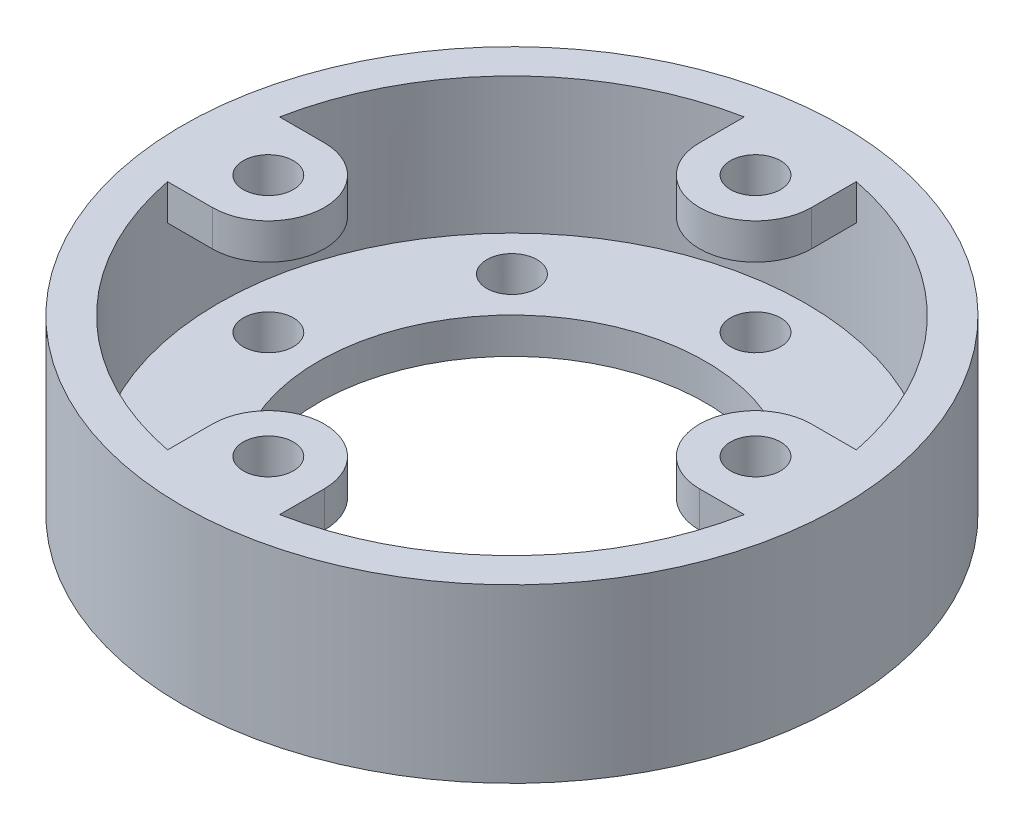
ISO-10303-21;
HEADER;
FILE_DESCRIPTION(('STEP AP214'),'2;1');
FILE_NAME('part.step','',(''),(''),'','','');
FILE_SCHEMA(('AUTOMOTIVE_DESIGN { 1 0 10303 214 1 1 1 1 }'));
ENDSEC;
DATA;
#1=APPLICATION_CONTEXT('core data for automotive mechanical design processes');
#2=APPLICATION_PROTOCOL_DEFINITION('international standard','automotive_design',2000,#1);
#3=PRODUCT_CONTEXT('',#1,'mechanical');
#4=PRODUCT('Part','Part','',(#3));
#5=PRODUCT_RELATED_PRODUCT_CATEGORY('part','',(#4));
#6=PRODUCT_DEFINITION_FORMATION('','',#4);
#7=PRODUCT_DEFINITION_CONTEXT('part definition',#1,'design');
#8=PRODUCT_DEFINITION('design','',#6,#7);
#9=PRODUCT_DEFINITION_SHAPE('','',#8);
#10=(LENGTH_UNIT() NAMED_UNIT(*) SI_UNIT(.MILLI.,.METRE.));
#11=(NAMED_UNIT(*) PLANE_ANGLE_UNIT() SI_UNIT($,.RADIAN.));
#12=(NAMED_UNIT(*) SI_UNIT($,.STERADIAN.) SOLID_ANGLE_UNIT());
#13=UNCERTAINTY_MEASURE_WITH_UNIT(LENGTH_MEASURE(1.E-05),#10,'distance_accuracy_value','');
#14=(GEOMETRIC_REPRESENTATION_CONTEXT(3) GLOBAL_UNCERTAINTY_ASSIGNED_CONTEXT((#13)) GLOBAL_UNIT_ASSIGNED_CONTEXT((#10,
#11,#12)) REPRESENTATION_CONTEXT('',''));
#15=CARTESIAN_POINT('',(0.,0.,0.));
#16=DIRECTION('',(0.,0.,1.));
#17=DIRECTION('',(1.,0.,0.));
#18=AXIS2_PLACEMENT_3D('',#15,#16,#17);
#19=CARTESIAN_POINT('',(0.,38.1,0.));
#20=DIRECTION('',(0.,-1.,0.));
#21=DIRECTION('',(0.,0.,-1.));
#22=AXIS2_PLACEMENT_3D('',#19,#20,#21);
#23=CYLINDRICAL_SURFACE('',#22,42.8625);
#24=CARTESIAN_POINT('',(0.,0.,0.));
#25=DIRECTION('',(0.,1.,0.));
#26=DIRECTION('',(0.,0.,1.));
#27=AXIS2_PLACEMENT_3D('',#24,#25,#26);
#28=CIRCLE('',#27,42.8625);
#29=CARTESIAN_POINT('',(0.,0.,42.8625));
#30=VERTEX_POINT('',#29);
#31=EDGE_CURVE('E343',#30,#30,#28,.T.);
#32=ORIENTED_EDGE('',*,*,#31,.F.);
#33=EDGE_LOOP('',(#32));
#34=FACE_BOUND('',#33,.T.);
#35=CARTESIAN_POINT('',(0.,7.9375,0.));
#36=DIRECTION('',(0.,1.,0.));
#37=DIRECTION('',(0.,0.,1.));
#38=AXIS2_PLACEMENT_3D('',#35,#36,#37);
#39=CIRCLE('',#38,42.8625);
#40=CARTESIAN_POINT('',(0.,7.9375,42.8625));
#41=VERTEX_POINT('',#40);
#42=EDGE_CURVE('E35',#41,#41,#39,.T.);
#43=ORIENTED_EDGE('',*,*,#42,.T.);
#44=EDGE_LOOP('',(#43));
#45=FACE_BOUND('',#44,.T.);
#46=ADVANCED_FACE('F31',(#34,#45),#23,.F.);
#47=CARTESIAN_POINT('',(0.,38.1,0.));
#48=DIRECTION('',(0.,1.,0.));
#49=DIRECTION('',(0.,0.,1.));
#50=AXIS2_PLACEMENT_3D('',#47,#48,#49);
#51=PLANE('',#50);
#52=CARTESIAN_POINT('',(0.,38.1,0.));
#53=DIRECTION('',(0.,1.,0.));
#54=DIRECTION('',(0.,0.,1.));
#55=AXIS2_PLACEMENT_3D('',#52,#53,#54);
#56=CIRCLE('',#55,65.0875);
#57=CARTESIAN_POINT('',(-12.4130389718077,38.1,-63.8928722138423));
#58=VERTEX_POINT('',#57);
#59=CARTESIAN_POINT('',(-63.8928722138422,38.1,-12.4130389718083));
#60=VERTEX_POINT('',#59);
#61=EDGE_CURVE('E337',#58,#60,#56,.T.);
#62=ORIENTED_EDGE('',*,*,#61,.F.);
#63=DIRECTION('',(0.,0.,1.));
#64=VECTOR('',#63,1.);
#65=CARTESIAN_POINT('',(-12.4130389718077,38.1,0.));
#66=LINE('',#65,#64);
#67=CARTESIAN_POINT('',(-12.4130389718077,38.1,-53.975));
#68=VERTEX_POINT('',#67);
#69=EDGE_CURVE('E262',#58,#68,#66,.T.);
#70=ORIENTED_EDGE('',*,*,#69,.T.);
#71=CARTESIAN_POINT('',(0.,38.1,-53.975));
#72=DIRECTION('',(0.,1.,0.));
#73=DIRECTION('',(0.,0.,1.));
#74=AXIS2_PLACEMENT_3D('',#71,#72,#73);
#75=CIRCLE('',#74,12.4130389718077);
#76=CARTESIAN_POINT('',(12.4130389718076,38.1,-53.975));
#77=VERTEX_POINT('',#76);
#78=EDGE_CURVE('E257',#77,#68,#75,.F.);
#79=ORIENTED_EDGE('',*,*,#78,.F.);
#80=DIRECTION('',(0.,0.,1.));
#81=VECTOR('',#80,1.);
#82=CARTESIAN_POINT('',(12.4130389718076,38.1,0.));
#83=LINE('',#82,#81);
#84=CARTESIAN_POINT('',(12.4130389718076,38.1,-63.8928722138423));
#85=VERTEX_POINT('',#84);
#86=EDGE_CURVE('E260',#85,#77,#83,.T.);
#87=ORIENTED_EDGE('',*,*,#86,.F.);
#88=CARTESIAN_POINT('',(63.8928722138424,38.1,-12.4130389718075));
#89=VERTEX_POINT('',#88);
#90=EDGE_CURVE('E336',#89,#85,#56,.T.);
#91=ORIENTED_EDGE('',*,*,#90,.F.);
#92=DIRECTION('',(-1.,0.,0.));
#93=VECTOR('',#92,1.);
#94=CARTESIAN_POINT('',(0.,38.1,-12.4130389718077));
#95=LINE('',#94,#93);
#96=CARTESIAN_POINT('',(53.975,38.1,-12.4130389718075));
#97=VERTEX_POINT('',#96);
#98=EDGE_CURVE('E228',#89,#97,#95,.T.);
#99=ORIENTED_EDGE('',*,*,#98,.T.);
#100=CARTESIAN_POINT('',(53.975,38.1,1.71105579656111E-13));
#101=DIRECTION('',(0.,1.,0.));
#102=DIRECTION('',(-1.,0.,0.));
#103=AXIS2_PLACEMENT_3D('',#100,#101,#102);
#104=CIRCLE('',#103,12.4130389718077);
#105=CARTESIAN_POINT('',(53.975,38.1,12.4130389718078));
#106=VERTEX_POINT('',#105);
#107=EDGE_CURVE('E223',#106,#97,#104,.F.);
#108=ORIENTED_EDGE('',*,*,#107,.F.);
#109=DIRECTION('',(-1.,0.,0.));
#110=VECTOR('',#109,1.);
#111=CARTESIAN_POINT('',(0.,38.1,12.4130389718076));
#112=LINE('',#111,#110);
#113=CARTESIAN_POINT('',(63.8928722138423,38.1,12.4130389718079));
#114=VERTEX_POINT('',#113);
#115=EDGE_CURVE('E226',#114,#106,#112,.T.);
#116=ORIENTED_EDGE('',*,*,#115,.F.);
#117=CARTESIAN_POINT('',(12.4130389718072,38.1,63.8928722138424));
#118=VERTEX_POINT('',#117);
#119=EDGE_CURVE('E571',#118,#114,#56,.T.);
#120=ORIENTED_EDGE('',*,*,#119,.F.);
#121=DIRECTION('',(0.,0.,-1.));
#122=VECTOR('',#121,1.);
#123=CARTESIAN_POINT('',(12.4130389718077,38.1,0.));
#124=LINE('',#123,#122);
#125=CARTESIAN_POINT('',(12.4130389718073,38.1,53.9750000000001));
#126=VERTEX_POINT('',#125);
#127=EDGE_CURVE('E194',#118,#126,#124,.T.);
#128=ORIENTED_EDGE('',*,*,#127,.T.);
#129=CARTESIAN_POINT('',(-3.5955839407199E-13,38.1,53.975));
#130=DIRECTION('',(0.,1.,0.));
#131=DIRECTION('',(0.,0.,-1.));
#132=AXIS2_PLACEMENT_3D('',#129,#130,#131);
#133=CIRCLE('',#132,12.4130389718077);
#134=CARTESIAN_POINT('',(-12.413038971808,38.1,53.9749999999999));
#135=VERTEX_POINT('',#134);
#136=EDGE_CURVE('E189',#135,#126,#133,.F.);
#137=ORIENTED_EDGE('',*,*,#136,.F.);
#138=DIRECTION('',(0.,0.,-1.));
#139=VECTOR('',#138,1.);
#140=CARTESIAN_POINT('',(-12.4130389718076,38.1,0.));
#141=LINE('',#140,#139);
#142=CARTESIAN_POINT('',(-12.4130389718081,38.1,63.8928722138422));
#143=VERTEX_POINT('',#142);
#144=EDGE_CURVE('E192',#143,#135,#141,.T.);
#145=ORIENTED_EDGE('',*,*,#144,.F.);
#146=CARTESIAN_POINT('',(-63.8928722138424,38.1,12.413038971807));
#147=VERTEX_POINT('',#146);
#148=EDGE_CURVE('E340',#147,#143,#56,.T.);
#149=ORIENTED_EDGE('',*,*,#148,.F.);
#150=DIRECTION('',(1.,0.,0.));
#151=VECTOR('',#150,1.);
#152=CARTESIAN_POINT('',(-1.23708125878737E-13,38.1,12.4130389718077));
#153=LINE('',#152,#151);
#154=CARTESIAN_POINT('',(-53.9750000000001,38.1,12.4130389718071));
#155=VERTEX_POINT('',#154);
#156=EDGE_CURVE('E152',#147,#155,#153,.T.);
#157=ORIENTED_EDGE('',*,*,#156,.T.);
#158=CARTESIAN_POINT('',(-53.975,38.1,-5.48011208487868E-13));
#159=DIRECTION('',(0.,1.,0.));
#160=DIRECTION('',(1.,0.,0.));
#161=AXIS2_PLACEMENT_3D('',#158,#159,#160);
#162=CIRCLE('',#161,12.4130389718077);
#163=CARTESIAN_POINT('',(-53.9749999999999,38.1,-12.4130389718082));
#164=VERTEX_POINT('',#163);
#165=EDGE_CURVE('E153',#164,#155,#162,.F.);
#166=ORIENTED_EDGE('',*,*,#165,.F.);
#167=DIRECTION('',(1.,0.,0.));
#168=VECTOR('',#167,1.);
#169=CARTESIAN_POINT('',(1.36331388306475E-13,38.1,-12.4130389718076));
#170=LINE('',#169,#168);
#171=EDGE_CURVE('E145',#60,#164,#170,.T.);
#172=ORIENTED_EDGE('',*,*,#171,.F.);
#173=EDGE_LOOP('',(#62,#70,#79,#87,#91,#99,#108,#116,#120,#128,#137,#145,#149,#157,#166,#172));
#174=FACE_BOUND('',#173,.T.);
#175=CARTESIAN_POINT('',(0.,38.1,0.));
#176=DIRECTION('',(0.,1.,0.));
#177=DIRECTION('',(0.,0.,1.));
#178=AXIS2_PLACEMENT_3D('',#175,#176,#177);
#179=CIRCLE('',#178,73.025);
#180=CARTESIAN_POINT('',(0.,38.1,73.025));
#181=VERTEX_POINT('',#180);
#182=EDGE_CURVE('E11',#181,#181,#179,.T.);
#183=ORIENTED_EDGE('',*,*,#182,.T.);
#184=EDGE_LOOP('',(#183));
#185=FACE_BOUND('',#184,.T.);
#186=CARTESIAN_POINT('',(0.,38.1,-53.975));
#187=DIRECTION('',(0.,1.,0.));
#188=DIRECTION('',(0.,0.,1.));
#189=AXIS2_PLACEMENT_3D('',#186,#187,#188);
#190=CIRCLE('',#189,5.55625);
#191=CARTESIAN_POINT('',(0.,38.1,-48.41875));
#192=VERTEX_POINT('',#191);
#193=EDGE_CURVE('E246',#192,#192,#190,.T.);
#194=ORIENTED_EDGE('',*,*,#193,.F.);
#195=EDGE_LOOP('',(#194));
#196=FACE_BOUND('',#195,.T.);
#197=CARTESIAN_POINT('',(53.975,38.1,1.71105579656111E-13));
#198=DIRECTION('',(0.,1.,0.));
#199=DIRECTION('',(-1.,0.,0.));
#200=AXIS2_PLACEMENT_3D('',#197,#198,#199);
#201=CIRCLE('',#200,5.55625);
#202=CARTESIAN_POINT('',(48.41875,38.1,1.51706025230947E-13));
#203=VERTEX_POINT('',#202);
#204=EDGE_CURVE('E212',#203,#203,#201,.T.);
#205=ORIENTED_EDGE('',*,*,#204,.F.);
#206=EDGE_LOOP('',(#205));
#207=FACE_BOUND('',#206,.T.);
#208=CARTESIAN_POINT('',(-3.5955839407199E-13,38.1,53.975));
#209=DIRECTION('',(0.,1.,0.));
#210=DIRECTION('',(0.,0.,-1.));
#211=AXIS2_PLACEMENT_3D('',#208,#209,#210);
#212=CIRCLE('',#211,5.55625);
#213=CARTESIAN_POINT('',(-3.20759285221662E-13,38.1,48.41875));
#214=VERTEX_POINT('',#213);
#215=EDGE_CURVE('E183',#214,#214,#212,.T.);
#216=ORIENTED_EDGE('',*,*,#215,.F.);
#217=EDGE_LOOP('',(#216));
#218=FACE_BOUND('',#217,.T.);
#219=CARTESIAN_POINT('',(-53.975,38.1,-5.48011208487868E-13));
#220=DIRECTION('',(0.,1.,0.));
#221=DIRECTION('',(1.,0.,0.));
#222=AXIS2_PLACEMENT_3D('',#219,#220,#221);
#223=CIRCLE('',#222,5.55625);
#224=CARTESIAN_POINT('',(-48.41875,38.1,-4.89812545212376E-13));
#225=VERTEX_POINT('',#224);
#226=EDGE_CURVE('E166',#225,#225,#223,.T.);
#227=ORIENTED_EDGE('',*,*,#226,.F.);
#228=EDGE_LOOP('',(#227));
#229=FACE_BOUND('',#228,.T.);
#230=ADVANCED_FACE('F163',(#174,#185,#196,#207,#218,#229),#51,.T.);
#231=CARTESIAN_POINT('',(0.,0.,0.));
#232=DIRECTION('',(0.,1.,0.));
#233=DIRECTION('',(0.,0.,1.));
#234=AXIS2_PLACEMENT_3D('',#231,#232,#233);
#235=PLANE('',#234);
#236=CARTESIAN_POINT('',(-38.1660885145434,0.,-38.1660885145444));
#237=DIRECTION('',(0.,1.,0.));
#238=DIRECTION('',(0.,0.,1.));
#239=AXIS2_PLACEMENT_3D('',#236,#237,#238);
#240=CIRCLE('',#239,5.55625);
#241=CARTESIAN_POINT('',(-38.1660885145434,0.,-32.6098385145444));
#242=VERTEX_POINT('',#241);
#243=EDGE_CURVE('E291',#242,#242,#240,.T.);
#244=ORIENTED_EDGE('',*,*,#243,.T.);
#245=EDGE_LOOP('',(#244));
#246=FACE_BOUND('',#245,.T.);
#247=CARTESIAN_POINT('',(-53.975,0.,-5.65358443247637E-13));
#248=DIRECTION('',(0.,1.,0.));
#249=DIRECTION('',(0.,0.,1.));
#250=AXIS2_PLACEMENT_3D('',#247,#248,#249);
#251=CIRCLE('',#250,5.55625);
#252=CARTESIAN_POINT('',(-53.975,0.,5.55624999999943));
#253=VERTEX_POINT('',#252);
#254=EDGE_CURVE('E297',#253,#253,#251,.T.);
#255=ORIENTED_EDGE('',*,*,#254,.T.);
#256=EDGE_LOOP('',(#255));
#257=FACE_BOUND('',#256,.T.);
#258=CARTESIAN_POINT('',(-38.1660885145442,0.,38.1660885145436));
#259=DIRECTION('',(0.,1.,0.));
#260=DIRECTION('',(0.,0.,1.));
#261=AXIS2_PLACEMENT_3D('',#258,#259,#260);
#262=CIRCLE('',#261,5.55625);
#263=CARTESIAN_POINT('',(-38.1660885145442,0.,43.7223385145436));
#264=VERTEX_POINT('',#263);
#265=EDGE_CURVE('E303',#264,#264,#262,.T.);
#266=ORIENTED_EDGE('',*,*,#265,.T.);
#267=EDGE_LOOP('',(#266));
#268=FACE_BOUND('',#267,.T.);
#269=CARTESIAN_POINT('',(-3.76905628831758E-13,0.,53.975));
#270=DIRECTION('',(0.,1.,0.));
#271=DIRECTION('',(0.,0.,1.));
#272=AXIS2_PLACEMENT_3D('',#269,#270,#271);
#273=CIRCLE('',#272,5.55625);
#274=CARTESIAN_POINT('',(-3.76905628831758E-13,0.,59.53125));
#275=VERTEX_POINT('',#274);
#276=EDGE_CURVE('E309',#275,#275,#273,.T.);
#277=ORIENTED_EDGE('',*,*,#276,.T.);
#278=EDGE_LOOP('',(#277));
#279=FACE_BOUND('',#278,.T.);
#280=CARTESIAN_POINT('',(38.1660885145437,0.,38.1660885145441));
#281=DIRECTION('',(0.,1.,0.));
#282=DIRECTION('',(0.,0.,1.));
#283=AXIS2_PLACEMENT_3D('',#280,#281,#282);
#284=CIRCLE('',#283,5.55625);
#285=CARTESIAN_POINT('',(38.1660885145437,0.,43.7223385145441));
#286=VERTEX_POINT('',#285);
#287=EDGE_CURVE('E315',#286,#286,#284,.T.);
#288=ORIENTED_EDGE('',*,*,#287,.T.);
#289=EDGE_LOOP('',(#288));
#290=FACE_BOUND('',#289,.T.);
#291=CARTESIAN_POINT('',(53.975,0.,1.88452814415879E-13));
#292=DIRECTION('',(0.,1.,0.));
#293=DIRECTION('',(0.,0.,1.));
#294=AXIS2_PLACEMENT_3D('',#291,#292,#293);
#295=CIRCLE('',#294,5.55625);
#296=CARTESIAN_POINT('',(53.975,0.,5.55625000000019));
#297=VERTEX_POINT('',#296);
#298=EDGE_CURVE('E321',#297,#297,#295,.T.);
#299=ORIENTED_EDGE('',*,*,#298,.T.);
#300=EDGE_LOOP('',(#299));
#301=FACE_BOUND('',#300,.T.);
#302=CARTESIAN_POINT('',(38.166088514544,0.,-38.1660885145438));
#303=DIRECTION('',(0.,1.,0.));
#304=DIRECTION('',(0.,0.,1.));
#305=AXIS2_PLACEMENT_3D('',#302,#303,#304);
#306=CIRCLE('',#305,5.55625);
#307=CARTESIAN_POINT('',(38.166088514544,0.,-32.6098385145438));
#308=VERTEX_POINT('',#307);
#309=EDGE_CURVE('E327',#308,#308,#306,.T.);
#310=ORIENTED_EDGE('',*,*,#309,.T.);
#311=EDGE_LOOP('',(#310));
#312=FACE_BOUND('',#311,.T.);
#313=CARTESIAN_POINT('',(0.,0.,-53.975));
#314=DIRECTION('',(0.,1.,0.));
#315=DIRECTION('',(0.,0.,1.));
#316=AXIS2_PLACEMENT_3D('',#313,#314,#315);
#317=CIRCLE('',#316,5.55625);
#318=CARTESIAN_POINT('',(0.,0.,-48.41875));
#319=VERTEX_POINT('',#318);
#320=EDGE_CURVE('E333',#319,#319,#317,.T.);
#321=ORIENTED_EDGE('',*,*,#320,.T.);
#322=EDGE_LOOP('',(#321));
#323=FACE_BOUND('',#322,.T.);
#324=CARTESIAN_POINT('',(0.,0.,0.));
#325=DIRECTION('',(0.,1.,0.));
#326=DIRECTION('',(0.,0.,1.));
#327=AXIS2_PLACEMENT_3D('',#324,#325,#326);
#328=CIRCLE('',#327,73.025);
#329=CARTESIAN_POINT('',(0.,0.,73.025));
#330=VERTEX_POINT('',#329);
#331=EDGE_CURVE('E40',#330,#330,#328,.T.);
#332=ORIENTED_EDGE('',*,*,#331,.F.);
#333=EDGE_LOOP('',(#332));
#334=FACE_BOUND('',#333,.T.);
#335=ORIENTED_EDGE('',*,*,#31,.T.);
#336=EDGE_LOOP('',(#335));
#337=FACE_BOUND('',#336,.T.);
#338=ADVANCED_FACE('F350',(#246,#257,#268,#279,#290,#301,#312,#323,#334,#337),#235,.F.);
#339=CARTESIAN_POINT('',(0.,38.1,0.));
#340=DIRECTION('',(0.,-1.,0.));
#341=DIRECTION('',(0.,0.,-1.));
#342=AXIS2_PLACEMENT_3D('',#339,#340,#341);
#343=CYLINDRICAL_SURFACE('',#342,73.025);
#344=ORIENTED_EDGE('',*,*,#182,.F.);
#345=EDGE_LOOP('',(#344));
#346=FACE_BOUND('',#345,.T.);
#347=ORIENTED_EDGE('',*,*,#331,.T.);
#348=EDGE_LOOP('',(#347));
#349=FACE_BOUND('',#348,.T.);
#350=ADVANCED_FACE('F33',(#346,#349),#343,.T.);
#351=CARTESIAN_POINT('',(0.,7.9375,0.));
#352=DIRECTION('',(0.,1.,0.));
#353=DIRECTION('',(0.,0.,1.));
#354=AXIS2_PLACEMENT_3D('',#351,#352,#353);
#355=CYLINDRICAL_SURFACE('',#354,65.0875);
#356=CARTESIAN_POINT('',(0.,30.1625,0.));
#357=DIRECTION('',(0.,1.,0.));
#358=DIRECTION('',(1.,0.,0.));
#359=AXIS2_PLACEMENT_3D('',#356,#357,#358);
#360=CIRCLE('',#359,65.0875);
#361=CARTESIAN_POINT('',(-63.8928722138422,30.1625,-12.4130389718083));
#362=VERTEX_POINT('',#361);
#363=CARTESIAN_POINT('',(-63.8928722138424,30.1625,12.413038971807));
#364=VERTEX_POINT('',#363);
#365=EDGE_CURVE('E52',#362,#364,#360,.T.);
#366=ORIENTED_EDGE('',*,*,#365,.T.);
#367=DIRECTION('',(0.,1.,0.));
#368=VECTOR('',#367,1.);
#369=CARTESIAN_POINT('',(-63.8928722138424,30.1625,12.413038971807));
#370=LINE('',#369,#368);
#371=EDGE_CURVE('E184',#364,#147,#370,.T.);
#372=ORIENTED_EDGE('',*,*,#371,.T.);
#373=ORIENTED_EDGE('',*,*,#148,.T.);
#374=DIRECTION('',(0.,1.,0.));
#375=VECTOR('',#374,1.);
#376=CARTESIAN_POINT('',(-12.4130389718081,30.1625,63.8928722138422));
#377=LINE('',#376,#375);
#378=CARTESIAN_POINT('',(-12.4130389718081,30.1625,63.8928722138422));
#379=VERTEX_POINT('',#378);
#380=EDGE_CURVE('E216',#379,#143,#377,.T.);
#381=ORIENTED_EDGE('',*,*,#380,.F.);
#382=CARTESIAN_POINT('',(0.,30.1625,0.));
#383=DIRECTION('',(0.,1.,0.));
#384=DIRECTION('',(0.,0.,-1.));
#385=AXIS2_PLACEMENT_3D('',#382,#383,#384);
#386=CIRCLE('',#385,65.0875);
#387=CARTESIAN_POINT('',(12.4130389718072,30.1625,63.8928722138424));
#388=VERTEX_POINT('',#387);
#389=EDGE_CURVE('E204',#379,#388,#386,.T.);
#390=ORIENTED_EDGE('',*,*,#389,.T.);
#391=DIRECTION('',(0.,1.,0.));
#392=VECTOR('',#391,1.);
#393=CARTESIAN_POINT('',(12.4130389718072,30.1625,63.8928722138424));
#394=LINE('',#393,#392);
#395=EDGE_CURVE('E213',#388,#118,#394,.T.);
#396=ORIENTED_EDGE('',*,*,#395,.T.);
#397=ORIENTED_EDGE('',*,*,#119,.T.);
#398=DIRECTION('',(0.,1.,0.));
#399=VECTOR('',#398,1.);
#400=CARTESIAN_POINT('',(63.8928722138423,30.1625,12.4130389718079));
#401=LINE('',#400,#399);
#402=CARTESIAN_POINT('',(63.8928722138423,30.1625,12.4130389718079));
#403=VERTEX_POINT('',#402);
#404=EDGE_CURVE('E250',#403,#114,#401,.T.);
#405=ORIENTED_EDGE('',*,*,#404,.F.);
#406=CARTESIAN_POINT('',(0.,30.1625,0.));
#407=DIRECTION('',(0.,1.,0.));
#408=DIRECTION('',(-1.,0.,0.));
#409=AXIS2_PLACEMENT_3D('',#406,#407,#408);
#410=CIRCLE('',#409,65.0875);
#411=CARTESIAN_POINT('',(63.8928722138424,30.1625,-12.4130389718075));
#412=VERTEX_POINT('',#411);
#413=EDGE_CURVE('E238',#403,#412,#410,.T.);
#414=ORIENTED_EDGE('',*,*,#413,.T.);
#415=DIRECTION('',(0.,1.,0.));
#416=VECTOR('',#415,1.);
#417=CARTESIAN_POINT('',(63.8928722138424,30.1625,-12.4130389718075));
#418=LINE('',#417,#416);
#419=EDGE_CURVE('E247',#412,#89,#418,.T.);
#420=ORIENTED_EDGE('',*,*,#419,.T.);
#421=ORIENTED_EDGE('',*,*,#90,.T.);
#422=DIRECTION('',(0.,1.,0.));
#423=VECTOR('',#422,1.);
#424=CARTESIAN_POINT('',(12.4130389718076,30.1625,-63.8928722138423));
#425=LINE('',#424,#423);
#426=CARTESIAN_POINT('',(12.4130389718076,30.1625,-63.8928722138423));
#427=VERTEX_POINT('',#426);
#428=EDGE_CURVE('E284',#427,#85,#425,.T.);
#429=ORIENTED_EDGE('',*,*,#428,.F.);
#430=CARTESIAN_POINT('',(0.,30.1625,0.));
#431=DIRECTION('',(0.,1.,0.));
#432=DIRECTION('',(0.,0.,1.));
#433=AXIS2_PLACEMENT_3D('',#430,#431,#432);
#434=CIRCLE('',#433,65.0875);
#435=CARTESIAN_POINT('',(-12.4130389718077,30.1625,-63.8928722138423));
#436=VERTEX_POINT('',#435);
#437=EDGE_CURVE('E272',#427,#436,#434,.T.);
#438=ORIENTED_EDGE('',*,*,#437,.T.);
#439=DIRECTION('',(0.,1.,0.));
#440=VECTOR('',#439,1.);
#441=CARTESIAN_POINT('',(-12.4130389718077,30.1625,-63.8928722138423));
#442=LINE('',#441,#440);
#443=EDGE_CURVE('E281',#436,#58,#442,.T.);
#444=ORIENTED_EDGE('',*,*,#443,.T.);
#445=ORIENTED_EDGE('',*,*,#61,.T.);
#446=DIRECTION('',(0.,1.,0.));
#447=VECTOR('',#446,1.);
#448=CARTESIAN_POINT('',(-63.8928722138422,30.1625,-12.4130389718083));
#449=LINE('',#448,#447);
#450=EDGE_CURVE('E47',#362,#60,#449,.T.);
#451=ORIENTED_EDGE('',*,*,#450,.F.);
#452=EDGE_LOOP('',(#366,#372,#373,#381,#390,#396,#397,#405,#414,#420,#421,#429,#438,#444,#445,#451));
#453=FACE_BOUND('',#452,.T.);
#454=CARTESIAN_POINT('',(0.,7.9375,0.));
#455=DIRECTION('',(0.,1.,0.));
#456=DIRECTION('',(0.,0.,1.));
#457=AXIS2_PLACEMENT_3D('',#454,#455,#456);
#458=CIRCLE('',#457,65.0875);
#459=CARTESIAN_POINT('',(0.,7.9375,65.0875));
#460=VERTEX_POINT('',#459);
#461=EDGE_CURVE('E339',#460,#460,#458,.T.);
#462=ORIENTED_EDGE('',*,*,#461,.F.);
#463=EDGE_LOOP('',(#462));
#464=FACE_BOUND('',#463,.T.);
#465=ADVANCED_FACE('F367',(#453,#464),#355,.F.);
#466=CARTESIAN_POINT('',(0.,7.9375,0.));
#467=DIRECTION('',(0.,1.,0.));
#468=DIRECTION('',(0.,0.,1.));
#469=AXIS2_PLACEMENT_3D('',#466,#467,#468);
#470=PLANE('',#469);
#471=CARTESIAN_POINT('',(-38.1660885145434,7.9375,-38.1660885145444));
#472=DIRECTION('',(0.,1.,0.));
#473=DIRECTION('',(0.707106781186539,0.,0.707106781186556));
#474=AXIS2_PLACEMENT_3D('',#471,#472,#473);
#475=CIRCLE('',#474,5.55625);
#476=CARTESIAN_POINT('',(-34.2372264615757,7.9375,-34.2372264615766));
#477=VERTEX_POINT('',#476);
#478=EDGE_CURVE('E280',#477,#477,#475,.T.);
#479=ORIENTED_EDGE('',*,*,#478,.F.);
#480=EDGE_LOOP('',(#479));
#481=FACE_BOUND('',#480,.T.);
#482=CARTESIAN_POINT('',(-53.975,7.9375,-5.65358443247637E-13));
#483=DIRECTION('',(0.,1.,0.));
#484=DIRECTION('',(1.,0.,0.));
#485=AXIS2_PLACEMENT_3D('',#482,#483,#484);
#486=CIRCLE('',#485,5.55625);
#487=CARTESIAN_POINT('',(-48.41875,7.9375,-5.07159779972145E-13));
#488=VERTEX_POINT('',#487);
#489=EDGE_CURVE('E294',#488,#488,#486,.T.);
#490=ORIENTED_EDGE('',*,*,#489,.F.);
#491=EDGE_LOOP('',(#490));
#492=FACE_BOUND('',#491,.T.);
#493=CARTESIAN_POINT('',(-38.1660885145442,7.9375,38.1660885145436));
#494=DIRECTION('',(0.,1.,0.));
#495=DIRECTION('',(0.707106781186554,0.,-0.707106781186541));
#496=AXIS2_PLACEMENT_3D('',#493,#494,#495);
#497=CIRCLE('',#496,5.55625);
#498=CARTESIAN_POINT('',(-34.2372264615764,7.9375,34.2372264615759));
#499=VERTEX_POINT('',#498);
#500=EDGE_CURVE('E300',#499,#499,#497,.T.);
#501=ORIENTED_EDGE('',*,*,#500,.F.);
#502=EDGE_LOOP('',(#501));
#503=FACE_BOUND('',#502,.T.);
#504=CARTESIAN_POINT('',(-3.76905628831758E-13,7.9375,53.975));
#505=DIRECTION('',(0.,1.,0.));
#506=DIRECTION('',(0.,0.,-1.));
#507=AXIS2_PLACEMENT_3D('',#504,#505,#506);
#508=CIRCLE('',#507,5.55625);
#509=CARTESIAN_POINT('',(-3.3810651998143E-13,7.9375,48.41875));
#510=VERTEX_POINT('',#509);
#511=EDGE_CURVE('E306',#510,#510,#508,.T.);
#512=ORIENTED_EDGE('',*,*,#511,.F.);
#513=EDGE_LOOP('',(#512));
#514=FACE_BOUND('',#513,.T.);
#515=CARTESIAN_POINT('',(38.1660885145437,7.9375,38.1660885145441));
#516=DIRECTION('',(0.,1.,0.));
#517=DIRECTION('',(-0.707106781186544,0.,-0.707106781186551));
#518=AXIS2_PLACEMENT_3D('',#515,#516,#517);
#519=CIRCLE('',#518,5.55625);
#520=CARTESIAN_POINT('',(34.237226461576,7.9375,34.2372264615763));
#521=VERTEX_POINT('',#520);
#522=EDGE_CURVE('E312',#521,#521,#519,.T.);
#523=ORIENTED_EDGE('',*,*,#522,.F.);
#524=EDGE_LOOP('',(#523));
#525=FACE_BOUND('',#524,.T.);
#526=CARTESIAN_POINT('',(53.975,7.9375,1.88452814415879E-13));
#527=DIRECTION('',(0.,1.,0.));
#528=DIRECTION('',(-1.,0.,0.));
#529=AXIS2_PLACEMENT_3D('',#526,#527,#528);
#530=CIRCLE('',#529,5.55625);
#531=CARTESIAN_POINT('',(48.41875,7.9375,1.69053259990715E-13));
#532=VERTEX_POINT('',#531);
#533=EDGE_CURVE('E318',#532,#532,#530,.T.);
#534=ORIENTED_EDGE('',*,*,#533,.F.);
#535=EDGE_LOOP('',(#534));
#536=FACE_BOUND('',#535,.T.);
#537=CARTESIAN_POINT('',(38.166088514544,7.9375,-38.1660885145438));
#538=DIRECTION('',(0.,1.,0.));
#539=DIRECTION('',(-0.707106781186549,0.,0.707106781186546));
#540=AXIS2_PLACEMENT_3D('',#537,#538,#539);
#541=CIRCLE('',#540,5.55625);
#542=CARTESIAN_POINT('',(34.2372264615762,7.9375,-34.2372264615761));
#543=VERTEX_POINT('',#542);
#544=EDGE_CURVE('E324',#543,#543,#541,.T.);
#545=ORIENTED_EDGE('',*,*,#544,.F.);
#546=EDGE_LOOP('',(#545));
#547=FACE_BOUND('',#546,.T.);
#548=CARTESIAN_POINT('',(0.,7.9375,-53.975));
#549=DIRECTION('',(0.,1.,0.));
#550=DIRECTION('',(0.,0.,1.));
#551=AXIS2_PLACEMENT_3D('',#548,#549,#550);
#552=CIRCLE('',#551,5.55625);
#553=CARTESIAN_POINT('',(0.,7.9375,-48.41875));
#554=VERTEX_POINT('',#553);
#555=EDGE_CURVE('E330',#554,#554,#552,.T.);
#556=ORIENTED_EDGE('',*,*,#555,.F.);
#557=EDGE_LOOP('',(#556));
#558=FACE_BOUND('',#557,.T.);
#559=ORIENTED_EDGE('',*,*,#42,.F.);
#560=EDGE_LOOP('',(#559));
#561=FACE_BOUND('',#560,.T.);
#562=ORIENTED_EDGE('',*,*,#461,.T.);
#563=EDGE_LOOP('',(#562));
#564=FACE_BOUND('',#563,.T.);
#565=ADVANCED_FACE('F363',(#481,#492,#503,#514,#525,#536,#547,#558,#561,#564),#470,.T.);
#566=CARTESIAN_POINT('',(0.,-22.225,-53.975));
#567=DIRECTION('',(0.,1.,0.));
#568=DIRECTION('',(0.,0.,1.));
#569=AXIS2_PLACEMENT_3D('',#566,#567,#568);
#570=CYLINDRICAL_SURFACE('',#569,5.55625);
#571=ORIENTED_EDGE('',*,*,#555,.T.);
#572=EDGE_LOOP('',(#571));
#573=FACE_BOUND('',#572,.T.);
#574=ORIENTED_EDGE('',*,*,#320,.F.);
#575=EDGE_LOOP('',(#574));
#576=FACE_BOUND('',#575,.T.);
#577=ADVANCED_FACE('F366',(#573,#576),#570,.F.);
#578=CARTESIAN_POINT('',(38.166088514544,-22.225,-38.1660885145438));
#579=DIRECTION('',(0.,1.,0.));
#580=DIRECTION('',(0.,0.,1.));
#581=AXIS2_PLACEMENT_3D('',#578,#579,#580);
#582=CYLINDRICAL_SURFACE('',#581,5.55625);
#583=ORIENTED_EDGE('',*,*,#544,.T.);
#584=EDGE_LOOP('',(#583));
#585=FACE_BOUND('',#584,.T.);
#586=ORIENTED_EDGE('',*,*,#309,.F.);
#587=EDGE_LOOP('',(#586));
#588=FACE_BOUND('',#587,.T.);
#589=ADVANCED_FACE('F473',(#585,#588),#582,.F.);
#590=CARTESIAN_POINT('',(53.975,-22.225,1.88452814415879E-13));
#591=DIRECTION('',(0.,1.,0.));
#592=DIRECTION('',(0.,0.,1.));
#593=AXIS2_PLACEMENT_3D('',#590,#591,#592);
#594=CYLINDRICAL_SURFACE('',#593,5.55625);
#595=ORIENTED_EDGE('',*,*,#533,.T.);
#596=EDGE_LOOP('',(#595));
#597=FACE_BOUND('',#596,.T.);
#598=ORIENTED_EDGE('',*,*,#298,.F.);
#599=EDGE_LOOP('',(#598));
#600=FACE_BOUND('',#599,.T.);
#601=ADVANCED_FACE('F465',(#597,#600),#594,.F.);
#602=CARTESIAN_POINT('',(38.1660885145437,-22.225,38.1660885145441));
#603=DIRECTION('',(0.,1.,0.));
#604=DIRECTION('',(0.,0.,1.));
#605=AXIS2_PLACEMENT_3D('',#602,#603,#604);
#606=CYLINDRICAL_SURFACE('',#605,5.55625);
#607=ORIENTED_EDGE('',*,*,#522,.T.);
#608=EDGE_LOOP('',(#607));
#609=FACE_BOUND('',#608,.T.);
#610=ORIENTED_EDGE('',*,*,#287,.F.);
#611=EDGE_LOOP('',(#610));
#612=FACE_BOUND('',#611,.T.);
#613=ADVANCED_FACE('F457',(#609,#612),#606,.F.);
#614=CARTESIAN_POINT('',(-3.76905628831758E-13,-22.225,53.975));
#615=DIRECTION('',(0.,1.,0.));
#616=DIRECTION('',(0.,0.,1.));
#617=AXIS2_PLACEMENT_3D('',#614,#615,#616);
#618=CYLINDRICAL_SURFACE('',#617,5.55625);
#619=ORIENTED_EDGE('',*,*,#511,.T.);
#620=EDGE_LOOP('',(#619));
#621=FACE_BOUND('',#620,.T.);
#622=ORIENTED_EDGE('',*,*,#276,.F.);
#623=EDGE_LOOP('',(#622));
#624=FACE_BOUND('',#623,.T.);
#625=ADVANCED_FACE('F449',(#621,#624),#618,.F.);
#626=CARTESIAN_POINT('',(-38.1660885145442,-22.225,38.1660885145436));
#627=DIRECTION('',(0.,1.,0.));
#628=DIRECTION('',(0.,0.,1.));
#629=AXIS2_PLACEMENT_3D('',#626,#627,#628);
#630=CYLINDRICAL_SURFACE('',#629,5.55625);
#631=ORIENTED_EDGE('',*,*,#500,.T.);
#632=EDGE_LOOP('',(#631));
#633=FACE_BOUND('',#632,.T.);
#634=ORIENTED_EDGE('',*,*,#265,.F.);
#635=EDGE_LOOP('',(#634));
#636=FACE_BOUND('',#635,.T.);
#637=ADVANCED_FACE('F441',(#633,#636),#630,.F.);
#638=CARTESIAN_POINT('',(-53.975,-22.225,-5.65358443247637E-13));
#639=DIRECTION('',(0.,1.,0.));
#640=DIRECTION('',(0.,0.,1.));
#641=AXIS2_PLACEMENT_3D('',#638,#639,#640);
#642=CYLINDRICAL_SURFACE('',#641,5.55625);
#643=ORIENTED_EDGE('',*,*,#489,.T.);
#644=EDGE_LOOP('',(#643));
#645=FACE_BOUND('',#644,.T.);
#646=ORIENTED_EDGE('',*,*,#254,.F.);
#647=EDGE_LOOP('',(#646));
#648=FACE_BOUND('',#647,.T.);
#649=ADVANCED_FACE('F433',(#645,#648),#642,.F.);
#650=CARTESIAN_POINT('',(-38.1660885145434,-22.225,-38.1660885145444));
#651=DIRECTION('',(0.,1.,0.));
#652=DIRECTION('',(0.,0.,1.));
#653=AXIS2_PLACEMENT_3D('',#650,#651,#652);
#654=CYLINDRICAL_SURFACE('',#653,5.55625);
#655=ORIENTED_EDGE('',*,*,#478,.T.);
#656=EDGE_LOOP('',(#655));
#657=FACE_BOUND('',#656,.T.);
#658=ORIENTED_EDGE('',*,*,#243,.F.);
#659=EDGE_LOOP('',(#658));
#660=FACE_BOUND('',#659,.T.);
#661=ADVANCED_FACE('F425',(#657,#660),#654,.F.);
#662=CARTESIAN_POINT('',(0.,30.1625,-53.975));
#663=DIRECTION('',(0.,1.,0.));
#664=DIRECTION('',(0.,0.,1.));
#665=AXIS2_PLACEMENT_3D('',#662,#663,#664);
#666=CYLINDRICAL_SURFACE('',#665,12.4130389718077);
#667=ORIENTED_EDGE('',*,*,#78,.T.);
#668=DIRECTION('',(0.,1.,0.));
#669=VECTOR('',#668,1.);
#670=CARTESIAN_POINT('',(-12.4130389718077,30.1625,-53.975));
#671=LINE('',#670,#669);
#672=CARTESIAN_POINT('',(-12.4130389718077,30.1625,-53.975));
#673=VERTEX_POINT('',#672);
#674=EDGE_CURVE('E278',#673,#68,#671,.T.);
#675=ORIENTED_EDGE('',*,*,#674,.F.);
#676=CARTESIAN_POINT('',(0.,30.1625,-53.975));
#677=DIRECTION('',(0.,1.,0.));
#678=DIRECTION('',(0.,0.,1.));
#679=AXIS2_PLACEMENT_3D('',#676,#677,#678);
#680=CIRCLE('',#679,12.4130389718077);
#681=CARTESIAN_POINT('',(12.4130389718076,30.1625,-53.975));
#682=VERTEX_POINT('',#681);
#683=EDGE_CURVE('E268',#682,#673,#680,.F.);
#684=ORIENTED_EDGE('',*,*,#683,.F.);
#685=DIRECTION('',(0.,1.,0.));
#686=VECTOR('',#685,1.);
#687=CARTESIAN_POINT('',(12.4130389718076,30.1625,-53.975));
#688=LINE('',#687,#686);
#689=EDGE_CURVE('E277',#682,#77,#688,.T.);
#690=ORIENTED_EDGE('',*,*,#689,.T.);
#691=EDGE_LOOP('',(#667,#675,#684,#690));
#692=FACE_BOUND('',#691,.T.);
#693=ADVANCED_FACE('F417',(#692),#666,.T.);
#694=CARTESIAN_POINT('',(-12.4130389718077,30.1625,0.));
#695=DIRECTION('',(-1.,0.,0.));
#696=DIRECTION('',(0.,0.,1.));
#697=AXIS2_PLACEMENT_3D('',#694,#695,#696);
#698=PLANE('',#697);
#699=ORIENTED_EDGE('',*,*,#69,.F.);
#700=ORIENTED_EDGE('',*,*,#443,.F.);
#701=DIRECTION('',(0.,0.,1.));
#702=VECTOR('',#701,1.);
#703=CARTESIAN_POINT('',(-12.4130389718077,30.1625,0.));
#704=LINE('',#703,#702);
#705=EDGE_CURVE('E274',#436,#673,#704,.T.);
#706=ORIENTED_EDGE('',*,*,#705,.T.);
#707=ORIENTED_EDGE('',*,*,#674,.T.);
#708=EDGE_LOOP('',(#699,#700,#706,#707));
#709=FACE_BOUND('',#708,.T.);
#710=ADVANCED_FACE('F409',(#709),#698,.T.);
#711=CARTESIAN_POINT('',(0.,30.1625,-53.975));
#712=DIRECTION('',(0.,1.,0.));
#713=DIRECTION('',(0.,0.,1.));
#714=AXIS2_PLACEMENT_3D('',#711,#712,#713);
#715=CYLINDRICAL_SURFACE('',#714,5.55625);
#716=CARTESIAN_POINT('',(0.,30.1625,-53.975));
#717=DIRECTION('',(0.,1.,0.));
#718=DIRECTION('',(0.,0.,1.));
#719=AXIS2_PLACEMENT_3D('',#716,#717,#718);
#720=CIRCLE('',#719,5.55625);
#721=CARTESIAN_POINT('',(0.,30.1625,-48.41875));
#722=VERTEX_POINT('',#721);
#723=EDGE_CURVE('E265',#722,#722,#720,.T.);
#724=ORIENTED_EDGE('',*,*,#723,.F.);
#725=EDGE_LOOP('',(#724));
#726=FACE_BOUND('',#725,.T.);
#727=ORIENTED_EDGE('',*,*,#193,.T.);
#728=EDGE_LOOP('',(#727));
#729=FACE_BOUND('',#728,.T.);
#730=ADVANCED_FACE('F401',(#726,#729),#715,.F.);
#731=CARTESIAN_POINT('',(12.4130389718076,30.1625,0.));
#732=DIRECTION('',(-1.,0.,0.));
#733=DIRECTION('',(0.,0.,1.));
#734=AXIS2_PLACEMENT_3D('',#731,#732,#733);
#735=PLANE('',#734);
#736=ORIENTED_EDGE('',*,*,#86,.T.);
#737=ORIENTED_EDGE('',*,*,#689,.F.);
#738=DIRECTION('',(0.,0.,1.));
#739=VECTOR('',#738,1.);
#740=CARTESIAN_POINT('',(12.4130389718076,30.1625,0.));
#741=LINE('',#740,#739);
#742=EDGE_CURVE('E270',#427,#682,#741,.T.);
#743=ORIENTED_EDGE('',*,*,#742,.F.);
#744=ORIENTED_EDGE('',*,*,#428,.T.);
#745=EDGE_LOOP('',(#736,#737,#743,#744));
#746=FACE_BOUND('',#745,.T.);
#747=ADVANCED_FACE('F393',(#746),#735,.F.);
#748=CARTESIAN_POINT('',(-160.796421356237,30.1625,0.));
#749=DIRECTION('',(0.,1.,0.));
#750=DIRECTION('',(0.,0.,1.));
#751=AXIS2_PLACEMENT_3D('',#748,#749,#750);
#752=PLANE('',#751);
#753=ORIENTED_EDGE('',*,*,#723,.T.);
#754=EDGE_LOOP('',(#753));
#755=FACE_BOUND('',#754,.T.);
#756=ORIENTED_EDGE('',*,*,#683,.T.);
#757=ORIENTED_EDGE('',*,*,#705,.F.);
#758=ORIENTED_EDGE('',*,*,#437,.F.);
#759=ORIENTED_EDGE('',*,*,#742,.T.);
#760=EDGE_LOOP('',(#756,#757,#758,#759));
#761=FACE_BOUND('',#760,.T.);
#762=ADVANCED_FACE('F389',(#755,#761),#752,.F.);
#763=CARTESIAN_POINT('',(53.975,30.1625,1.71105579656111E-13));
#764=DIRECTION('',(0.,1.,0.));
#765=DIRECTION('',(0.,0.,1.));
#766=AXIS2_PLACEMENT_3D('',#763,#764,#765);
#767=CYLINDRICAL_SURFACE('',#766,12.4130389718077);
#768=ORIENTED_EDGE('',*,*,#107,.T.);
#769=DIRECTION('',(0.,1.,0.));
#770=VECTOR('',#769,1.);
#771=CARTESIAN_POINT('',(53.975,30.1625,-12.4130389718075));
#772=LINE('',#771,#770);
#773=CARTESIAN_POINT('',(53.975,30.1625,-12.4130389718075));
#774=VERTEX_POINT('',#773);
#775=EDGE_CURVE('E244',#774,#97,#772,.T.);
#776=ORIENTED_EDGE('',*,*,#775,.F.);
#777=CARTESIAN_POINT('',(53.975,30.1625,1.71105579656111E-13));
#778=DIRECTION('',(0.,1.,0.));
#779=DIRECTION('',(-1.,0.,0.));
#780=AXIS2_PLACEMENT_3D('',#777,#778,#779);
#781=CIRCLE('',#780,12.4130389718077);
#782=CARTESIAN_POINT('',(53.975,30.1625,12.4130389718078));
#783=VERTEX_POINT('',#782);
#784=EDGE_CURVE('E234',#783,#774,#781,.F.);
#785=ORIENTED_EDGE('',*,*,#784,.F.);
#786=DIRECTION('',(0.,1.,0.));
#787=VECTOR('',#786,1.);
#788=CARTESIAN_POINT('',(53.975,30.1625,12.4130389718078));
#789=LINE('',#788,#787);
#790=EDGE_CURVE('E243',#783,#106,#789,.T.);
#791=ORIENTED_EDGE('',*,*,#790,.T.);
#792=EDGE_LOOP('',(#768,#776,#785,#791));
#793=FACE_BOUND('',#792,.T.);
#794=ADVANCED_FACE('F392',(#793),#767,.T.);
#795=CARTESIAN_POINT('',(0.,30.1625,-12.4130389718077));
#796=DIRECTION('',(0.,0.,-1.));
#797=DIRECTION('',(-1.,0.,0.));
#798=AXIS2_PLACEMENT_3D('',#795,#796,#797);
#799=PLANE('',#798);
#800=ORIENTED_EDGE('',*,*,#98,.F.);
#801=ORIENTED_EDGE('',*,*,#419,.F.);
#802=DIRECTION('',(-1.,0.,0.));
#803=VECTOR('',#802,1.);
#804=CARTESIAN_POINT('',(0.,30.1625,-12.4130389718077));
#805=LINE('',#804,#803);
#806=EDGE_CURVE('E240',#412,#774,#805,.T.);
#807=ORIENTED_EDGE('',*,*,#806,.T.);
#808=ORIENTED_EDGE('',*,*,#775,.T.);
#809=EDGE_LOOP('',(#800,#801,#807,#808));
#810=FACE_BOUND('',#809,.T.);
#811=ADVANCED_FACE('F515',(#810),#799,.T.);
#812=CARTESIAN_POINT('',(53.975,30.1625,1.71105579656111E-13));
#813=DIRECTION('',(0.,1.,0.));
#814=DIRECTION('',(0.,0.,1.));
#815=AXIS2_PLACEMENT_3D('',#812,#813,#814);
#816=CYLINDRICAL_SURFACE('',#815,5.55625);
#817=CARTESIAN_POINT('',(53.975,30.1625,1.71105579656111E-13));
#818=DIRECTION('',(0.,1.,0.));
#819=DIRECTION('',(-1.,0.,0.));
#820=AXIS2_PLACEMENT_3D('',#817,#818,#819);
#821=CIRCLE('',#820,5.55625);
#822=CARTESIAN_POINT('',(48.41875,30.1625,1.51706025230947E-13));
#823=VERTEX_POINT('',#822);
#824=EDGE_CURVE('E231',#823,#823,#821,.T.);
#825=ORIENTED_EDGE('',*,*,#824,.F.);
#826=EDGE_LOOP('',(#825));
#827=FACE_BOUND('',#826,.T.);
#828=ORIENTED_EDGE('',*,*,#204,.T.);
#829=EDGE_LOOP('',(#828));
#830=FACE_BOUND('',#829,.T.);
#831=ADVANCED_FACE('F511',(#827,#830),#816,.F.);
#832=CARTESIAN_POINT('',(0.,30.1625,12.4130389718076));
#833=DIRECTION('',(0.,0.,-1.));
#834=DIRECTION('',(-1.,0.,0.));
#835=AXIS2_PLACEMENT_3D('',#832,#833,#834);
#836=PLANE('',#835);
#837=ORIENTED_EDGE('',*,*,#115,.T.);
#838=ORIENTED_EDGE('',*,*,#790,.F.);
#839=DIRECTION('',(-1.,0.,0.));
#840=VECTOR('',#839,1.);
#841=CARTESIAN_POINT('',(0.,30.1625,12.4130389718076));
#842=LINE('',#841,#840);
#843=EDGE_CURVE('E236',#403,#783,#842,.T.);
#844=ORIENTED_EDGE('',*,*,#843,.F.);
#845=ORIENTED_EDGE('',*,*,#404,.T.);
#846=EDGE_LOOP('',(#837,#838,#844,#845));
#847=FACE_BOUND('',#846,.T.);
#848=ADVANCED_FACE('F514',(#847),#836,.F.);
#849=CARTESIAN_POINT('',(5.55106398477367E-13,30.1625,-160.796421356237));
#850=DIRECTION('',(0.,1.,0.));
#851=DIRECTION('',(-1.,0.,0.));
#852=AXIS2_PLACEMENT_3D('',#849,#850,#851);
#853=PLANE('',#852);
#854=ORIENTED_EDGE('',*,*,#824,.T.);
#855=EDGE_LOOP('',(#854));
#856=FACE_BOUND('',#855,.T.);
#857=ORIENTED_EDGE('',*,*,#784,.T.);
#858=ORIENTED_EDGE('',*,*,#806,.F.);
#859=ORIENTED_EDGE('',*,*,#413,.F.);
#860=ORIENTED_EDGE('',*,*,#843,.T.);
#861=EDGE_LOOP('',(#857,#858,#859,#860));
#862=FACE_BOUND('',#861,.T.);
#863=ADVANCED_FACE('F521',(#856,#862),#853,.F.);
#864=CARTESIAN_POINT('',(-3.5955839407199E-13,30.1625,53.975));
#865=DIRECTION('',(0.,1.,0.));
#866=DIRECTION('',(0.,0.,1.));
#867=AXIS2_PLACEMENT_3D('',#864,#865,#866);
#868=CYLINDRICAL_SURFACE('',#867,12.4130389718077);
#869=ORIENTED_EDGE('',*,*,#136,.T.);
#870=DIRECTION('',(0.,1.,0.));
#871=VECTOR('',#870,1.);
#872=CARTESIAN_POINT('',(12.4130389718073,30.1625,53.9750000000001));
#873=LINE('',#872,#871);
#874=CARTESIAN_POINT('',(12.4130389718073,30.1625,53.9750000000001));
#875=VERTEX_POINT('',#874);
#876=EDGE_CURVE('E210',#875,#126,#873,.T.);
#877=ORIENTED_EDGE('',*,*,#876,.F.);
#878=CARTESIAN_POINT('',(-3.5955839407199E-13,30.1625,53.975));
#879=DIRECTION('',(0.,1.,0.));
#880=DIRECTION('',(0.,0.,-1.));
#881=AXIS2_PLACEMENT_3D('',#878,#879,#880);
#882=CIRCLE('',#881,12.4130389718077);
#883=CARTESIAN_POINT('',(-12.413038971808,30.1625,53.9749999999999));
#884=VERTEX_POINT('',#883);
#885=EDGE_CURVE('E200',#884,#875,#882,.F.);
#886=ORIENTED_EDGE('',*,*,#885,.F.);
#887=DIRECTION('',(0.,1.,0.));
#888=VECTOR('',#887,1.);
#889=CARTESIAN_POINT('',(-12.413038971808,30.1625,53.9749999999999));
#890=LINE('',#889,#888);
#891=EDGE_CURVE('E209',#884,#135,#890,.T.);
#892=ORIENTED_EDGE('',*,*,#891,.T.);
#893=EDGE_LOOP('',(#869,#877,#886,#892));
#894=FACE_BOUND('',#893,.T.);
#895=ADVANCED_FACE('F528',(#894),#868,.T.);
#896=CARTESIAN_POINT('',(12.4130389718077,30.1625,0.));
#897=DIRECTION('',(1.,0.,0.));
#898=DIRECTION('',(0.,0.,-1.));
#899=AXIS2_PLACEMENT_3D('',#896,#897,#898);
#900=PLANE('',#899);
#901=ORIENTED_EDGE('',*,*,#127,.F.);
#902=ORIENTED_EDGE('',*,*,#395,.F.);
#903=DIRECTION('',(0.,0.,-1.));
#904=VECTOR('',#903,1.);
#905=CARTESIAN_POINT('',(12.4130389718077,30.1625,0.));
#906=LINE('',#905,#904);
#907=EDGE_CURVE('E206',#388,#875,#906,.T.);
#908=ORIENTED_EDGE('',*,*,#907,.T.);
#909=ORIENTED_EDGE('',*,*,#876,.T.);
#910=EDGE_LOOP('',(#901,#902,#908,#909));
#911=FACE_BOUND('',#910,.T.);
#912=ADVANCED_FACE('F534',(#911),#900,.T.);
#913=CARTESIAN_POINT('',(-3.5955839407199E-13,30.1625,53.975));
#914=DIRECTION('',(0.,1.,0.));
#915=DIRECTION('',(0.,0.,1.));
#916=AXIS2_PLACEMENT_3D('',#913,#914,#915);
#917=CYLINDRICAL_SURFACE('',#916,5.55625);
#918=CARTESIAN_POINT('',(-3.5955839407199E-13,30.1625,53.975));
#919=DIRECTION('',(0.,1.,0.));
#920=DIRECTION('',(0.,0.,-1.));
#921=AXIS2_PLACEMENT_3D('',#918,#919,#920);
#922=CIRCLE('',#921,5.55625);
#923=CARTESIAN_POINT('',(-3.20759285221662E-13,30.1625,48.41875));
#924=VERTEX_POINT('',#923);
#925=EDGE_CURVE('E197',#924,#924,#922,.T.);
#926=ORIENTED_EDGE('',*,*,#925,.F.);
#927=EDGE_LOOP('',(#926));
#928=FACE_BOUND('',#927,.T.);
#929=ORIENTED_EDGE('',*,*,#215,.T.);
#930=EDGE_LOOP('',(#929));
#931=FACE_BOUND('',#930,.T.);
#932=ADVANCED_FACE('F530',(#928,#931),#917,.F.);
#933=CARTESIAN_POINT('',(-12.4130389718076,30.1625,0.));
#934=DIRECTION('',(1.,0.,0.));
#935=DIRECTION('',(0.,0.,-1.));
#936=AXIS2_PLACEMENT_3D('',#933,#934,#935);
#937=PLANE('',#936);
#938=ORIENTED_EDGE('',*,*,#144,.T.);
#939=ORIENTED_EDGE('',*,*,#891,.F.);
#940=DIRECTION('',(0.,0.,-1.));
#941=VECTOR('',#940,1.);
#942=CARTESIAN_POINT('',(-12.4130389718076,30.1625,0.));
#943=LINE('',#942,#941);
#944=EDGE_CURVE('E202',#379,#884,#943,.T.);
#945=ORIENTED_EDGE('',*,*,#944,.F.);
#946=ORIENTED_EDGE('',*,*,#380,.T.);
#947=EDGE_LOOP('',(#938,#939,#945,#946));
#948=FACE_BOUND('',#947,.T.);
#949=ADVANCED_FACE('F533',(#948),#937,.F.);
#950=CARTESIAN_POINT('',(160.796421356237,30.1625,1.1165244281686E-12));
#951=DIRECTION('',(0.,1.,0.));
#952=DIRECTION('',(0.,0.,-1.));
#953=AXIS2_PLACEMENT_3D('',#950,#951,#952);
#954=PLANE('',#953);
#955=ORIENTED_EDGE('',*,*,#925,.T.);
#956=EDGE_LOOP('',(#955));
#957=FACE_BOUND('',#956,.T.);
#958=ORIENTED_EDGE('',*,*,#885,.T.);
#959=ORIENTED_EDGE('',*,*,#907,.F.);
#960=ORIENTED_EDGE('',*,*,#389,.F.);
#961=ORIENTED_EDGE('',*,*,#944,.T.);
#962=EDGE_LOOP('',(#958,#959,#960,#961));
#963=FACE_BOUND('',#962,.T.);
#964=ADVANCED_FACE('F541',(#957,#963),#954,.F.);
#965=CARTESIAN_POINT('',(-53.975,30.1625,-5.48011208487868E-13));
#966=DIRECTION('',(0.,1.,0.));
#967=DIRECTION('',(0.,0.,1.));
#968=AXIS2_PLACEMENT_3D('',#965,#966,#967);
#969=CYLINDRICAL_SURFACE('',#968,12.4130389718077);
#970=ORIENTED_EDGE('',*,*,#165,.T.);
#971=DIRECTION('',(0.,1.,0.));
#972=VECTOR('',#971,1.);
#973=CARTESIAN_POINT('',(-53.9750000000001,30.1625,12.4130389718071));
#974=LINE('',#973,#972);
#975=CARTESIAN_POINT('',(-53.9750000000001,30.1625,12.4130389718071));
#976=VERTEX_POINT('',#975);
#977=EDGE_CURVE('E181',#976,#155,#974,.T.);
#978=ORIENTED_EDGE('',*,*,#977,.F.);
#979=CARTESIAN_POINT('',(-53.975,30.1625,-5.48011208487868E-13));
#980=DIRECTION('',(0.,1.,0.));
#981=DIRECTION('',(1.,0.,0.));
#982=AXIS2_PLACEMENT_3D('',#979,#980,#981);
#983=CIRCLE('',#982,12.4130389718077);
#984=CARTESIAN_POINT('',(-53.9749999999999,30.1625,-12.4130389718082));
#985=VERTEX_POINT('',#984);
#986=EDGE_CURVE('E160',#985,#976,#983,.F.);
#987=ORIENTED_EDGE('',*,*,#986,.F.);
#988=DIRECTION('',(0.,1.,0.));
#989=VECTOR('',#988,1.);
#990=CARTESIAN_POINT('',(-53.9749999999999,30.1625,-12.4130389718082));
#991=LINE('',#990,#989);
#992=EDGE_CURVE('E148',#985,#164,#991,.T.);
#993=ORIENTED_EDGE('',*,*,#992,.T.);
#994=EDGE_LOOP('',(#970,#978,#987,#993));
#995=FACE_BOUND('',#994,.T.);
#996=ADVANCED_FACE('F157',(#995),#969,.T.);
#997=CARTESIAN_POINT('',(-1.23708125878737E-13,30.1625,12.4130389718077));
#998=DIRECTION('',(0.,0.,1.));
#999=DIRECTION('',(1.,0.,0.));
#1000=AXIS2_PLACEMENT_3D('',#997,#998,#999);
#1001=PLANE('',#1000);
#1002=ORIENTED_EDGE('',*,*,#156,.F.);
#1003=ORIENTED_EDGE('',*,*,#371,.F.);
#1004=DIRECTION('',(1.,0.,0.));
#1005=VECTOR('',#1004,1.);
#1006=CARTESIAN_POINT('',(-1.23708125878737E-13,30.1625,12.4130389718077));
#1007=LINE('',#1006,#1005);
#1008=EDGE_CURVE('E161',#364,#976,#1007,.T.);
#1009=ORIENTED_EDGE('',*,*,#1008,.T.);
#1010=ORIENTED_EDGE('',*,*,#977,.T.);
#1011=EDGE_LOOP('',(#1002,#1003,#1009,#1010));
#1012=FACE_BOUND('',#1011,.T.);
#1013=ADVANCED_FACE('F552',(#1012),#1001,.T.);
#1014=CARTESIAN_POINT('',(-53.975,30.1625,-5.48011208487868E-13));
#1015=DIRECTION('',(0.,1.,0.));
#1016=DIRECTION('',(0.,0.,1.));
#1017=AXIS2_PLACEMENT_3D('',#1014,#1015,#1016);
#1018=CYLINDRICAL_SURFACE('',#1017,5.55625);
#1019=CARTESIAN_POINT('',(-53.975,30.1625,-5.48011208487868E-13));
#1020=DIRECTION('',(0.,1.,0.));
#1021=DIRECTION('',(1.,0.,0.));
#1022=AXIS2_PLACEMENT_3D('',#1019,#1020,#1021);
#1023=CIRCLE('',#1022,5.55625);
#1024=CARTESIAN_POINT('',(-48.41875,30.1625,-4.89812545212376E-13));
#1025=VERTEX_POINT('',#1024);
#1026=EDGE_CURVE('E172',#1025,#1025,#1023,.T.);
#1027=ORIENTED_EDGE('',*,*,#1026,.F.);
#1028=EDGE_LOOP('',(#1027));
#1029=FACE_BOUND('',#1028,.T.);
#1030=ORIENTED_EDGE('',*,*,#226,.T.);
#1031=EDGE_LOOP('',(#1030));
#1032=FACE_BOUND('',#1031,.T.);
#1033=ADVANCED_FACE('F549',(#1029,#1032),#1018,.F.);
#1034=CARTESIAN_POINT('',(1.36331388306475E-13,30.1625,-12.4130389718076));
#1035=DIRECTION('',(0.,0.,1.));
#1036=DIRECTION('',(1.,0.,0.));
#1037=AXIS2_PLACEMENT_3D('',#1034,#1035,#1036);
#1038=PLANE('',#1037);
#1039=ORIENTED_EDGE('',*,*,#171,.T.);
#1040=ORIENTED_EDGE('',*,*,#992,.F.);
#1041=DIRECTION('',(1.,0.,0.));
#1042=VECTOR('',#1041,1.);
#1043=CARTESIAN_POINT('',(1.36331388306475E-13,30.1625,-12.4130389718076));
#1044=LINE('',#1043,#1042);
#1045=EDGE_CURVE('E176',#362,#985,#1044,.T.);
#1046=ORIENTED_EDGE('',*,*,#1045,.F.);
#1047=ORIENTED_EDGE('',*,*,#450,.T.);
#1048=EDGE_LOOP('',(#1039,#1040,#1046,#1047));
#1049=FACE_BOUND('',#1048,.T.);
#1050=ADVANCED_FACE('F147',(#1049),#1038,.F.);
#1051=CARTESIAN_POINT('',(-1.67794245785984E-12,30.1625,160.796421356237));
#1052=DIRECTION('',(0.,1.,0.));
#1053=DIRECTION('',(1.,0.,0.));
#1054=AXIS2_PLACEMENT_3D('',#1051,#1052,#1053);
#1055=PLANE('',#1054);
#1056=ORIENTED_EDGE('',*,*,#1026,.T.);
#1057=EDGE_LOOP('',(#1056));
#1058=FACE_BOUND('',#1057,.T.);
#1059=ORIENTED_EDGE('',*,*,#986,.T.);
#1060=ORIENTED_EDGE('',*,*,#1008,.F.);
#1061=ORIENTED_EDGE('',*,*,#365,.F.);
#1062=ORIENTED_EDGE('',*,*,#1045,.T.);
#1063=EDGE_LOOP('',(#1059,#1060,#1061,#1062));
#1064=FACE_BOUND('',#1063,.T.);
#1065=ADVANCED_FACE('F558',(#1058,#1064),#1055,.F.);
#1066=CLOSED_SHELL('',(#46,#230,#338,#350,#465,#565,#577,#589,#601,#613,#625,#637,#649,#661,
#693,#710,#730,#747,#762,#794,#811,#831,#848,#863,#895,#912,#932,#949,#964,#996,#1013,#1033,
#1050,#1065));
#1067=MANIFOLD_SOLID_BREP('B2',#1066);
#1068=ADVANCED_BREP_SHAPE_REPRESENTATION('',(#18,#1067),#14);
#1069=SHAPE_DEFINITION_REPRESENTATION(#9,#1068);
ENDSEC;
END-ISO-10303-21;
